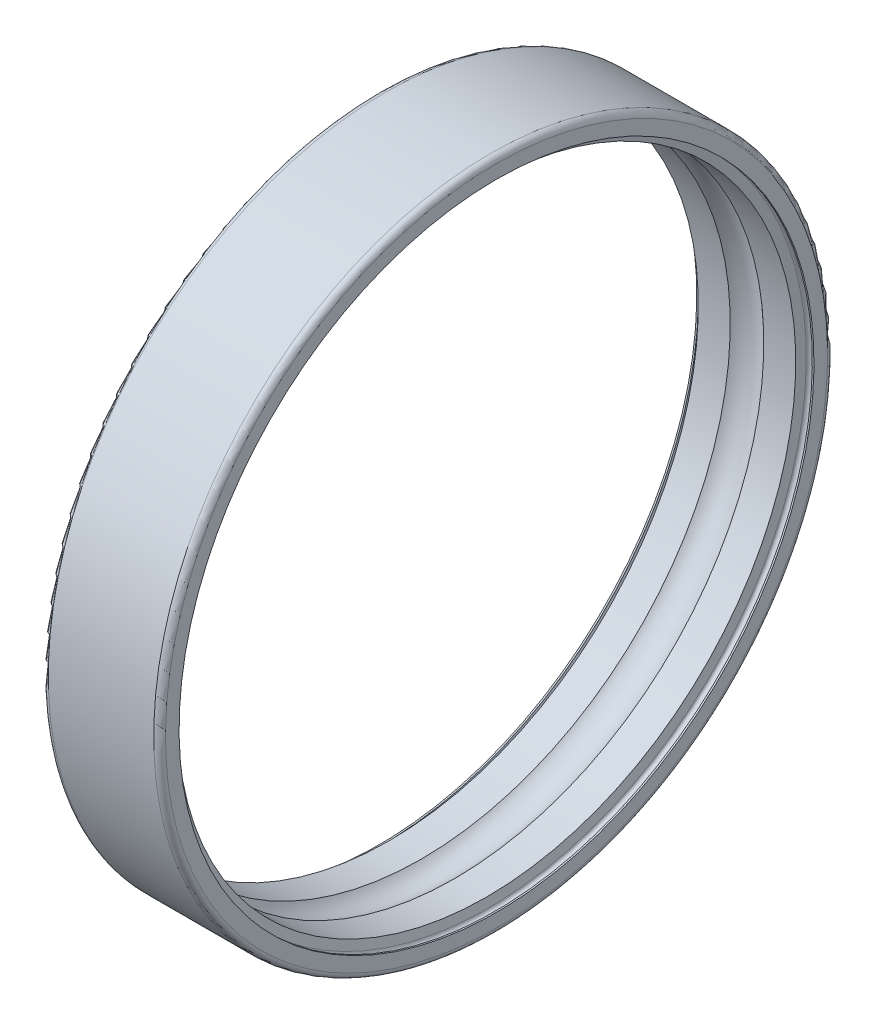
ISO-10303-21;
HEADER;
FILE_DESCRIPTION(('STEP AP214'),'2;1');
FILE_NAME('part.step','',(''),(''),'','','');
FILE_SCHEMA(('AUTOMOTIVE_DESIGN { 1 0 10303 214 1 1 1 1 }'));
ENDSEC;
DATA;
#1=APPLICATION_CONTEXT('core data for automotive mechanical design processes');
#2=APPLICATION_PROTOCOL_DEFINITION('international standard','automotive_design',2000,#1);
#3=PRODUCT_CONTEXT('',#1,'mechanical');
#4=PRODUCT('Part','Part','',(#3));
#5=PRODUCT_RELATED_PRODUCT_CATEGORY('part','',(#4));
#6=PRODUCT_DEFINITION_FORMATION('','',#4);
#7=PRODUCT_DEFINITION_CONTEXT('part definition',#1,'design');
#8=PRODUCT_DEFINITION('design','',#6,#7);
#9=PRODUCT_DEFINITION_SHAPE('','',#8);
#10=(LENGTH_UNIT() NAMED_UNIT(*) SI_UNIT(.MILLI.,.METRE.));
#11=(NAMED_UNIT(*) PLANE_ANGLE_UNIT() SI_UNIT($,.RADIAN.));
#12=(NAMED_UNIT(*) SI_UNIT($,.STERADIAN.) SOLID_ANGLE_UNIT());
#13=UNCERTAINTY_MEASURE_WITH_UNIT(LENGTH_MEASURE(1.E-05),#10,'distance_accuracy_value','');
#14=(GEOMETRIC_REPRESENTATION_CONTEXT(3) GLOBAL_UNCERTAINTY_ASSIGNED_CONTEXT((#13)) GLOBAL_UNIT_ASSIGNED_CONTEXT((#10,
#11,#12)) REPRESENTATION_CONTEXT('',''));
#15=CARTESIAN_POINT('',(0.,0.,0.));
#16=DIRECTION('',(0.,0.,1.));
#17=DIRECTION('',(1.,0.,0.));
#18=AXIS2_PLACEMENT_3D('',#15,#16,#17);
#19=CARTESIAN_POINT('',(3.829,0.,0.));
#20=DIRECTION('',(1.,0.,0.));
#21=DIRECTION('',(0.,0.,-1.));
#22=AXIS2_PLACEMENT_3D('',#19,#20,#21);
#23=TOROIDAL_SURFACE('',#22,10.835,0.114);
#24=CARTESIAN_POINT('',(3.943,0.,0.));
#25=DIRECTION('',(1.,0.,0.));
#26=DIRECTION('',(0.,1.,0.));
#27=AXIS2_PLACEMENT_3D('',#24,#25,#26);
#28=CIRCLE('',#27,10.835);
#29=CARTESIAN_POINT('',(3.943,10.835,0.));
#30=VERTEX_POINT('',#29);
#31=EDGE_CURVE('E11',#30,#30,#28,.T.);
#32=ORIENTED_EDGE('',*,*,#31,.T.);
#33=EDGE_LOOP('',(#32));
#34=FACE_BOUND('',#33,.T.);
#35=CARTESIAN_POINT('',(3.71673191615661,0.,0.));
#36=DIRECTION('',(1.,0.,0.));
#37=DIRECTION('',(0.,1.,0.));
#38=AXIS2_PLACEMENT_3D('',#35,#36,#37);
#39=CIRCLE('',#38,10.854795892254);
#40=CARTESIAN_POINT('',(3.71673191615661,10.854795892254,0.));
#41=VERTEX_POINT('',#40);
#42=EDGE_CURVE('E94',#41,#41,#39,.T.);
#43=ORIENTED_EDGE('',*,*,#42,.F.);
#44=EDGE_LOOP('',(#43));
#45=FACE_BOUND('',#44,.T.);
#46=ADVANCED_FACE('F16',(#34,#45),#23,.F.);
#47=CARTESIAN_POINT('',(3.9715,0.,0.));
#48=DIRECTION('',(-1.,0.,0.));
#49=DIRECTION('',(0.,1.,0.));
#50=AXIS2_PLACEMENT_3D('',#47,#48,#49);
#51=CYLINDRICAL_SURFACE('',#50,10.835);
#52=CARTESIAN_POINT('',(4.,0.,0.));
#53=DIRECTION('',(1.,0.,0.));
#54=DIRECTION('',(0.,1.,0.));
#55=AXIS2_PLACEMENT_3D('',#52,#53,#54);
#56=CIRCLE('',#55,10.835);
#57=CARTESIAN_POINT('',(4.,10.835,0.));
#58=VERTEX_POINT('',#57);
#59=EDGE_CURVE('E26',#58,#58,#56,.T.);
#60=ORIENTED_EDGE('',*,*,#59,.T.);
#61=EDGE_LOOP('',(#60));
#62=FACE_BOUND('',#61,.T.);
#63=ORIENTED_EDGE('',*,*,#31,.F.);
#64=EDGE_LOOP('',(#63));
#65=FACE_BOUND('',#64,.T.);
#66=ADVANCED_FACE('F119',(#62,#65),#51,.F.);
#67=CARTESIAN_POINT('',(4.,11.0675,0.));
#68=DIRECTION('',(1.,0.,0.));
#69=DIRECTION('',(0.,1.,0.));
#70=AXIS2_PLACEMENT_3D('',#67,#68,#69);
#71=PLANE('',#70);
#72=CARTESIAN_POINT('',(4.,0.,0.));
#73=DIRECTION('',(1.,0.,0.));
#74=DIRECTION('',(0.,1.,0.));
#75=AXIS2_PLACEMENT_3D('',#72,#73,#74);
#76=CIRCLE('',#75,11.3);
#77=CARTESIAN_POINT('',(4.,11.3,0.));
#78=VERTEX_POINT('',#77);
#79=EDGE_CURVE('E84',#78,#78,#76,.T.);
#80=ORIENTED_EDGE('',*,*,#79,.T.);
#81=EDGE_LOOP('',(#80));
#82=FACE_BOUND('',#81,.T.);
#83=ORIENTED_EDGE('',*,*,#59,.F.);
#84=EDGE_LOOP('',(#83));
#85=FACE_BOUND('',#84,.T.);
#86=ADVANCED_FACE('F106',(#82,#85),#71,.T.);
#87=CARTESIAN_POINT('',(3.8,0.,0.));
#88=DIRECTION('',(1.,0.,0.));
#89=DIRECTION('',(0.,0.,-1.));
#90=AXIS2_PLACEMENT_3D('',#87,#88,#89);
#91=TOROIDAL_SURFACE('',#90,11.3,0.2);
#92=CARTESIAN_POINT('',(3.8,0.,0.));
#93=DIRECTION('',(1.,0.,0.));
#94=DIRECTION('',(0.,1.,0.));
#95=AXIS2_PLACEMENT_3D('',#92,#93,#94);
#96=CIRCLE('',#95,11.5);
#97=CARTESIAN_POINT('',(3.8,11.5,0.));
#98=VERTEX_POINT('',#97);
#99=EDGE_CURVE('E74',#98,#98,#96,.T.);
#100=ORIENTED_EDGE('',*,*,#99,.T.);
#101=EDGE_LOOP('',(#100));
#102=FACE_BOUND('',#101,.T.);
#103=ORIENTED_EDGE('',*,*,#79,.F.);
#104=EDGE_LOOP('',(#103));
#105=FACE_BOUND('',#104,.T.);
#106=ADVANCED_FACE('F109',(#102,#105),#91,.T.);
#107=CARTESIAN_POINT('',(2.,0.,0.));
#108=DIRECTION('',(-1.,0.,0.));
#109=DIRECTION('',(0.,1.,0.));
#110=AXIS2_PLACEMENT_3D('',#107,#108,#109);
#111=CYLINDRICAL_SURFACE('',#110,11.5);
#112=CARTESIAN_POINT('',(0.2,0.,0.));
#113=DIRECTION('',(1.,0.,0.));
#114=DIRECTION('',(0.,1.,0.));
#115=AXIS2_PLACEMENT_3D('',#112,#113,#114);
#116=CIRCLE('',#115,11.5);
#117=CARTESIAN_POINT('',(0.2,11.5,0.));
#118=VERTEX_POINT('',#117);
#119=EDGE_CURVE('E78',#118,#118,#116,.T.);
#120=ORIENTED_EDGE('',*,*,#119,.T.);
#121=EDGE_LOOP('',(#120));
#122=FACE_BOUND('',#121,.T.);
#123=ORIENTED_EDGE('',*,*,#99,.F.);
#124=EDGE_LOOP('',(#123));
#125=FACE_BOUND('',#124,.T.);
#126=ADVANCED_FACE('F79',(#122,#125),#111,.T.);
#127=CARTESIAN_POINT('',(0.2,0.,0.));
#128=DIRECTION('',(1.,0.,0.));
#129=DIRECTION('',(0.,0.,-1.));
#130=AXIS2_PLACEMENT_3D('',#127,#128,#129);
#131=TOROIDAL_SURFACE('',#130,11.3,0.2);
#132=CARTESIAN_POINT('',(0.,0.,0.));
#133=DIRECTION('',(1.,0.,0.));
#134=DIRECTION('',(0.,1.,0.));
#135=AXIS2_PLACEMENT_3D('',#132,#133,#134);
#136=CIRCLE('',#135,11.3);
#137=CARTESIAN_POINT('',(0.,11.3,0.));
#138=VERTEX_POINT('',#137);
#139=EDGE_CURVE('E82',#138,#138,#136,.T.);
#140=ORIENTED_EDGE('',*,*,#139,.T.);
#141=EDGE_LOOP('',(#140));
#142=FACE_BOUND('',#141,.T.);
#143=ORIENTED_EDGE('',*,*,#119,.F.);
#144=EDGE_LOOP('',(#143));
#145=FACE_BOUND('',#144,.T.);
#146=ADVANCED_FACE('F117',(#142,#145),#131,.T.);
#147=CARTESIAN_POINT('',(0.,11.0675,0.));
#148=DIRECTION('',(-1.,0.,0.));
#149=DIRECTION('',(0.,-1.,0.));
#150=AXIS2_PLACEMENT_3D('',#147,#148,#149);
#151=PLANE('',#150);
#152=CARTESIAN_POINT('',(0.,0.,0.));
#153=DIRECTION('',(1.,0.,0.));
#154=DIRECTION('',(0.,1.,0.));
#155=AXIS2_PLACEMENT_3D('',#152,#153,#154);
#156=CIRCLE('',#155,10.835);
#157=CARTESIAN_POINT('',(0.,10.835,0.));
#158=VERTEX_POINT('',#157);
#159=EDGE_CURVE('E86',#158,#158,#156,.T.);
#160=ORIENTED_EDGE('',*,*,#159,.T.);
#161=EDGE_LOOP('',(#160));
#162=FACE_BOUND('',#161,.T.);
#163=ORIENTED_EDGE('',*,*,#139,.F.);
#164=EDGE_LOOP('',(#163));
#165=FACE_BOUND('',#164,.T.);
#166=ADVANCED_FACE('F134',(#162,#165),#151,.T.);
#167=CARTESIAN_POINT('',(0.0285,0.,0.));
#168=DIRECTION('',(-1.,0.,0.));
#169=DIRECTION('',(0.,1.,0.));
#170=AXIS2_PLACEMENT_3D('',#167,#168,#169);
#171=CYLINDRICAL_SURFACE('',#170,10.835);
#172=CARTESIAN_POINT('',(0.057,0.,0.));
#173=DIRECTION('',(1.,0.,0.));
#174=DIRECTION('',(0.,1.,0.));
#175=AXIS2_PLACEMENT_3D('',#172,#173,#174);
#176=CIRCLE('',#175,10.835);
#177=CARTESIAN_POINT('',(0.057,10.835,0.));
#178=VERTEX_POINT('',#177);
#179=EDGE_CURVE('E20',#178,#178,#176,.T.);
#180=ORIENTED_EDGE('',*,*,#179,.T.);
#181=EDGE_LOOP('',(#180));
#182=FACE_BOUND('',#181,.T.);
#183=ORIENTED_EDGE('',*,*,#159,.F.);
#184=EDGE_LOOP('',(#183));
#185=FACE_BOUND('',#184,.T.);
#186=ADVANCED_FACE('F131',(#182,#185),#171,.F.);
#187=CARTESIAN_POINT('',(0.171,0.,0.));
#188=DIRECTION('',(1.,0.,0.));
#189=DIRECTION('',(0.,0.,-1.));
#190=AXIS2_PLACEMENT_3D('',#187,#188,#189);
#191=TOROIDAL_SURFACE('',#190,10.835,0.114);
#192=CARTESIAN_POINT('',(0.283268083843392,0.,0.));
#193=DIRECTION('',(1.,0.,0.));
#194=DIRECTION('',(0.,1.,0.));
#195=AXIS2_PLACEMENT_3D('',#192,#193,#194);
#196=CIRCLE('',#195,10.854795892254);
#197=CARTESIAN_POINT('',(0.283268083843392,10.854795892254,0.));
#198=VERTEX_POINT('',#197);
#199=EDGE_CURVE('E89',#198,#198,#196,.T.);
#200=ORIENTED_EDGE('',*,*,#199,.T.);
#201=EDGE_LOOP('',(#200));
#202=FACE_BOUND('',#201,.T.);
#203=ORIENTED_EDGE('',*,*,#179,.F.);
#204=EDGE_LOOP('',(#203));
#205=FACE_BOUND('',#204,.T.);
#206=ADVANCED_FACE('F18',(#202,#205),#191,.F.);
#207=CARTESIAN_POINT('',(0.31013995355014,0.,0.));
#208=DIRECTION('',(-1.,0.,0.));
#209=DIRECTION('',(0.,1.,0.));
#210=AXIS2_PLACEMENT_3D('',#207,#208,#209);
#211=CONICAL_SURFACE('',#210,10.702397946127,1.39626340159546);
#212=CARTESIAN_POINT('',(0.337011823256887,0.,0.));
#213=DIRECTION('',(1.,0.,0.));
#214=DIRECTION('',(0.,1.,0.));
#215=AXIS2_PLACEMENT_3D('',#212,#213,#214);
#216=CIRCLE('',#215,10.55);
#217=CARTESIAN_POINT('',(0.337011823256887,10.55,0.));
#218=VERTEX_POINT('',#217);
#219=EDGE_CURVE('E57',#218,#218,#216,.T.);
#220=ORIENTED_EDGE('',*,*,#219,.T.);
#221=EDGE_LOOP('',(#220));
#222=FACE_BOUND('',#221,.T.);
#223=ORIENTED_EDGE('',*,*,#199,.F.);
#224=EDGE_LOOP('',(#223));
#225=FACE_BOUND('',#224,.T.);
#226=ADVANCED_FACE('F148',(#222,#225),#211,.F.);
#227=CARTESIAN_POINT('',(0.882177428937673,0.,0.));
#228=DIRECTION('',(-1.,0.,0.));
#229=DIRECTION('',(0.,1.,0.));
#230=AXIS2_PLACEMENT_3D('',#227,#228,#229);
#231=CYLINDRICAL_SURFACE('',#230,10.55);
#232=CARTESIAN_POINT('',(1.42734303461846,0.,0.));
#233=DIRECTION('',(1.,0.,0.));
#234=DIRECTION('',(0.,1.,0.));
#235=AXIS2_PLACEMENT_3D('',#232,#233,#234);
#236=CIRCLE('',#235,10.55);
#237=CARTESIAN_POINT('',(1.42734303461846,10.55,0.));
#238=VERTEX_POINT('',#237);
#239=EDGE_CURVE('E63',#238,#238,#236,.T.);
#240=ORIENTED_EDGE('',*,*,#239,.T.);
#241=EDGE_LOOP('',(#240));
#242=FACE_BOUND('',#241,.T.);
#243=ORIENTED_EDGE('',*,*,#219,.F.);
#244=EDGE_LOOP('',(#243));
#245=FACE_BOUND('',#244,.T.);
#246=ADVANCED_FACE('F146',(#242,#245),#231,.F.);
#247=CARTESIAN_POINT('',(2.,0.,0.));
#248=DIRECTION('',(1.,0.,0.));
#249=DIRECTION('',(0.,0.,-1.));
#250=AXIS2_PLACEMENT_3D('',#247,#248,#249);
#251=TOROIDAL_SURFACE('',#250,10.,0.794);
#252=CARTESIAN_POINT('',(2.57265696538154,0.,0.));
#253=DIRECTION('',(1.,0.,0.));
#254=DIRECTION('',(0.,1.,0.));
#255=AXIS2_PLACEMENT_3D('',#252,#253,#254);
#256=CIRCLE('',#255,10.55);
#257=CARTESIAN_POINT('',(2.57265696538154,10.55,0.));
#258=VERTEX_POINT('',#257);
#259=EDGE_CURVE('E95',#258,#258,#256,.T.);
#260=ORIENTED_EDGE('',*,*,#259,.T.);
#261=EDGE_LOOP('',(#260));
#262=FACE_BOUND('',#261,.T.);
#263=ORIENTED_EDGE('',*,*,#239,.F.);
#264=EDGE_LOOP('',(#263));
#265=FACE_BOUND('',#264,.T.);
#266=ADVANCED_FACE('F143',(#262,#265),#251,.F.);
#267=CARTESIAN_POINT('',(3.11782257106233,0.,0.));
#268=DIRECTION('',(-1.,0.,0.));
#269=DIRECTION('',(0.,1.,0.));
#270=AXIS2_PLACEMENT_3D('',#267,#268,#269);
#271=CYLINDRICAL_SURFACE('',#270,10.55);
#272=CARTESIAN_POINT('',(3.66298817674311,0.,0.));
#273=DIRECTION('',(1.,0.,0.));
#274=DIRECTION('',(0.,1.,0.));
#275=AXIS2_PLACEMENT_3D('',#272,#273,#274);
#276=CIRCLE('',#275,10.55);
#277=CARTESIAN_POINT('',(3.66298817674311,10.55,0.));
#278=VERTEX_POINT('',#277);
#279=EDGE_CURVE('E96',#278,#278,#276,.T.);
#280=ORIENTED_EDGE('',*,*,#279,.T.);
#281=EDGE_LOOP('',(#280));
#282=FACE_BOUND('',#281,.T.);
#283=ORIENTED_EDGE('',*,*,#259,.F.);
#284=EDGE_LOOP('',(#283));
#285=FACE_BOUND('',#284,.T.);
#286=ADVANCED_FACE('F139',(#282,#285),#271,.F.);
#287=CARTESIAN_POINT('',(3.68986004644986,0.,0.));
#288=DIRECTION('',(1.,0.,0.));
#289=DIRECTION('',(0.,1.,0.));
#290=AXIS2_PLACEMENT_3D('',#287,#288,#289);
#291=CONICAL_SURFACE('',#290,10.702397946127,1.39626340159546);
#292=ORIENTED_EDGE('',*,*,#42,.T.);
#293=EDGE_LOOP('',(#292));
#294=FACE_BOUND('',#293,.T.);
#295=ORIENTED_EDGE('',*,*,#279,.F.);
#296=EDGE_LOOP('',(#295));
#297=FACE_BOUND('',#296,.T.);
#298=ADVANCED_FACE('F142',(#294,#297),#291,.F.);
#299=CLOSED_SHELL('',(#46,#66,#86,#106,#126,#146,#166,#186,#206,#226,#246,#266,#286,#298));
#300=MANIFOLD_SOLID_BREP('B1',#299);
#301=ADVANCED_BREP_SHAPE_REPRESENTATION('',(#18,#300),#14);
#302=SHAPE_DEFINITION_REPRESENTATION(#9,#301);
ENDSEC;
END-ISO-10303-21;
